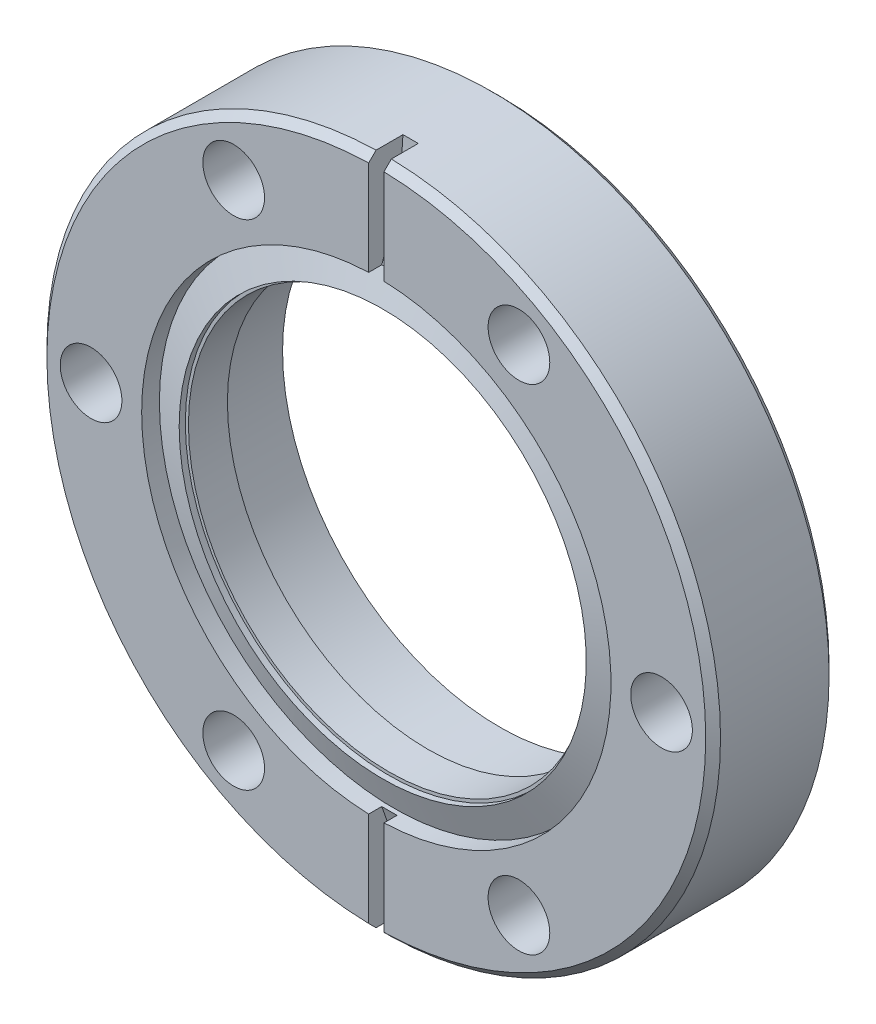
ISO-10303-21;
HEADER;
FILE_DESCRIPTION(('STEP AP214'),'2;1');
FILE_NAME('part.step','',(''),(''),'','','');
FILE_SCHEMA(('AUTOMOTIVE_DESIGN { 1 0 10303 214 1 1 1 1 }'));
ENDSEC;
DATA;
#1=APPLICATION_CONTEXT('core data for automotive mechanical design processes');
#2=APPLICATION_PROTOCOL_DEFINITION('international standard','automotive_design',2000,#1);
#3=PRODUCT_CONTEXT('',#1,'mechanical');
#4=PRODUCT('Part','Part','',(#3));
#5=PRODUCT_RELATED_PRODUCT_CATEGORY('part','',(#4));
#6=PRODUCT_DEFINITION_FORMATION('','',#4);
#7=PRODUCT_DEFINITION_CONTEXT('part definition',#1,'design');
#8=PRODUCT_DEFINITION('design','',#6,#7);
#9=PRODUCT_DEFINITION_SHAPE('','',#8);
#10=(LENGTH_UNIT() NAMED_UNIT(*) SI_UNIT(.MILLI.,.METRE.));
#11=(NAMED_UNIT(*) PLANE_ANGLE_UNIT() SI_UNIT($,.RADIAN.));
#12=(NAMED_UNIT(*) SI_UNIT($,.STERADIAN.) SOLID_ANGLE_UNIT());
#13=UNCERTAINTY_MEASURE_WITH_UNIT(LENGTH_MEASURE(1.E-05),#10,'distance_accuracy_value','');
#14=(GEOMETRIC_REPRESENTATION_CONTEXT(3) GLOBAL_UNCERTAINTY_ASSIGNED_CONTEXT((#13)) GLOBAL_UNIT_ASSIGNED_CONTEXT((#10,
#11,#12)) REPRESENTATION_CONTEXT('',''));
#15=CARTESIAN_POINT('',(0.,0.,0.));
#16=DIRECTION('',(0.,0.,1.));
#17=DIRECTION('',(1.,0.,0.));
#18=AXIS2_PLACEMENT_3D('',#15,#16,#17);
#19=CARTESIAN_POINT('',(0.,0.,0.));
#20=DIRECTION('',(0.,0.,-1.));
#21=DIRECTION('',(-1.,0.,0.));
#22=AXIS2_PLACEMENT_3D('',#19,#20,#21);
#23=CYLINDRICAL_SURFACE('',#22,20.9550000000005);
#24=CARTESIAN_POINT('',(0.,0.,11.4046000000001));
#25=DIRECTION('',(0.,0.,-1.));
#26=DIRECTION('',(-1.,0.,0.));
#27=AXIS2_PLACEMENT_3D('',#24,#25,#26);
#28=CIRCLE('',#27,20.9550000000005);
#29=CARTESIAN_POINT('',(-20.9550000000005,0.,11.4046000000001));
#30=VERTEX_POINT('',#29);
#31=EDGE_CURVE('E19',#30,#30,#28,.T.);
#32=ORIENTED_EDGE('',*,*,#31,.T.);
#33=EDGE_LOOP('',(#32));
#34=FACE_BOUND('',#33,.T.);
#35=CARTESIAN_POINT('',(0.,0.,12.0396000000003));
#36=DIRECTION('',(0.,0.,-1.));
#37=DIRECTION('',(-1.,0.,0.));
#38=AXIS2_PLACEMENT_3D('',#35,#36,#37);
#39=CIRCLE('',#38,20.9550000000001);
#40=CARTESIAN_POINT('',(-20.9550000000001,0.,12.0396000000003));
#41=VERTEX_POINT('',#40);
#42=EDGE_CURVE('E94',#41,#41,#39,.T.);
#43=ORIENTED_EDGE('',*,*,#42,.F.);
#44=EDGE_LOOP('',(#43));
#45=FACE_BOUND('',#44,.T.);
#46=ADVANCED_FACE('F16',(#34,#45),#23,.F.);
#47=CARTESIAN_POINT('',(0.,20.955,11.4045999999998));
#48=DIRECTION('',(0.,0.,-1.));
#49=DIRECTION('',(-1.,0.,0.));
#50=AXIS2_PLACEMENT_3D('',#47,#48,#49);
#51=PLANE('',#50);
#52=CARTESIAN_POINT('',(0.,0.,11.4046000000001));
#53=DIRECTION('',(0.,0.,1.));
#54=DIRECTION('',(1.,0.,0.));
#55=AXIS2_PLACEMENT_3D('',#52,#53,#54);
#56=CIRCLE('',#55,20.6375000000005);
#57=CARTESIAN_POINT('',(20.6375000000005,0.,11.4046000000001));
#58=VERTEX_POINT('',#57);
#59=EDGE_CURVE('E255',#58,#58,#56,.F.);
#60=ORIENTED_EDGE('',*,*,#59,.T.);
#61=EDGE_LOOP('',(#60));
#62=FACE_BOUND('',#61,.T.);
#63=ORIENTED_EDGE('',*,*,#31,.F.);
#64=EDGE_LOOP('',(#63));
#65=FACE_BOUND('',#64,.T.);
#66=ADVANCED_FACE('F375',(#62,#65),#51,.F.);
#67=CARTESIAN_POINT('',(0.,0.,10.8747496622545));
#68=DIRECTION('',(0.,0.,-1.));
#69=DIRECTION('',(0.,1.,0.));
#70=AXIS2_PLACEMENT_3D('',#67,#68,#69);
#71=CONICAL_SURFACE('',#70,24.1554000000005,1.22173047639603);
#72=ORIENTED_EDGE('',*,*,#42,.T.);
#73=EDGE_LOOP('',(#72));
#74=FACE_BOUND('',#73,.T.);
#75=CARTESIAN_POINT('',(0.,0.,10.8747496622546));
#76=DIRECTION('',(0.,0.,-1.));
#77=DIRECTION('',(-1.,0.,0.));
#78=AXIS2_PLACEMENT_3D('',#75,#76,#77);
#79=CIRCLE('',#78,24.1554000000005);
#80=CARTESIAN_POINT('',(-24.1554000000005,0.,10.8747496622546));
#81=VERTEX_POINT('',#80);
#82=EDGE_CURVE('E122',#81,#81,#79,.F.);
#83=ORIENTED_EDGE('',*,*,#82,.T.);
#84=EDGE_LOOP('',(#83));
#85=FACE_BOUND('',#84,.T.);
#86=ADVANCED_FACE('F261',(#74,#85),#71,.T.);
#87=CARTESIAN_POINT('',(-0.787400000000008,35.7647503648525,40.9005551970516));
#88=DIRECTION('',(1.,0.,0.));
#89=DIRECTION('',(0.,0.,-1.));
#90=AXIS2_PLACEMENT_3D('',#87,#88,#89);
#91=CYLINDRICAL_SURFACE('',#90,31.75);
#92=CARTESIAN_POINT('',(-0.787400000000029,24.1425630453775,11.3541973519459));
#93=CARTESIAN_POINT('',(-0.524933333333355,24.1511210151262,11.3508331839947));
#94=CARTESIAN_POINT('',(-0.262466666666681,24.1554000000005,11.349151100019));
#95=CARTESIAN_POINT('',(0.262466666666667,24.1554000000005,11.349151100019));
#96=CARTESIAN_POINT('',(0.524933333333341,24.1511210151262,11.3508331839946));
#97=CARTESIAN_POINT('',(0.787400000000015,24.1425630453775,11.3541973519459));
#98=B_SPLINE_CURVE_WITH_KNOTS('',3,(#92,#93,#94,#95,#96,#97),.UNSPECIFIED.,.F.,.F.,(4,2,4),(0.,
0.787520801034829,1.57504160206966),.UNSPECIFIED.);
#99=CARTESIAN_POINT('',(-0.787400000000018,24.1425630453772,11.3541973519461));
#100=VERTEX_POINT('',#99);
#101=CARTESIAN_POINT('',(0.787400000000004,24.1425630453772,11.3541973519461));
#102=VERTEX_POINT('',#101);
#103=EDGE_CURVE('E98',#100,#102,#98,.T.);
#104=ORIENTED_EDGE('',*,*,#103,.T.);
#105=CARTESIAN_POINT('',(0.787399999999994,35.7647503648525,40.9005551970516));
#106=DIRECTION('',(1.,0.,0.));
#107=DIRECTION('',(0.,0.,-1.));
#108=AXIS2_PLACEMENT_3D('',#105,#106,#107);
#109=CIRCLE('',#108,31.75);
#110=CARTESIAN_POINT('',(0.787400000000002,34.6620576746398,9.16970949715015));
#111=VERTEX_POINT('',#110);
#112=EDGE_CURVE('E96',#102,#111,#109,.T.);
#113=ORIENTED_EDGE('',*,*,#112,.T.);
#114=CARTESIAN_POINT('',(-0.787400000000024,34.6620576746398,9.16970949715015));
#115=CARTESIAN_POINT('',(-0.524933333333352,34.6680192248804,9.16950316571656));
#116=CARTESIAN_POINT('',(-0.262466666666679,34.6710000000008,9.16939999999977));
#117=CARTESIAN_POINT('',(0.262466666666666,34.6710000000008,9.16939999999977));
#118=CARTESIAN_POINT('',(0.524933333333339,34.6680192248804,9.16950316571656));
#119=CARTESIAN_POINT('',(0.787400000000011,34.6620576746398,9.16970949715015));
#120=B_SPLINE_CURVE_WITH_KNOTS('',3,(#114,#115,#116,#117,#118,#119),.UNSPECIFIED.,.F.,.F.,(4,2,
4),(0.,0.787450837177392,1.57490167435478),.UNSPECIFIED.);
#121=CARTESIAN_POINT('',(-0.787400000000016,34.6620576746398,9.16970949715015));
#122=VERTEX_POINT('',#121);
#123=EDGE_CURVE('E83',#122,#111,#120,.T.);
#124=ORIENTED_EDGE('',*,*,#123,.F.);
#125=CARTESIAN_POINT('',(-0.787400000000008,35.7647503648525,40.9005551970516));
#126=DIRECTION('',(1.,0.,0.));
#127=DIRECTION('',(0.,0.,-1.));
#128=AXIS2_PLACEMENT_3D('',#125,#126,#127);
#129=CIRCLE('',#128,31.75);
#130=EDGE_CURVE('E119',#100,#122,#129,.T.);
#131=ORIENTED_EDGE('',*,*,#130,.F.);
#132=EDGE_LOOP('',(#104,#113,#124,#131));
#133=FACE_BOUND('',#132,.T.);
#134=ADVANCED_FACE('F97',(#133),#91,.F.);
#135=CARTESIAN_POINT('',(-0.787400000000008,-35.7647503648532,40.900555197052));
#136=DIRECTION('',(1.,0.,0.));
#137=DIRECTION('',(0.,0.,-1.));
#138=AXIS2_PLACEMENT_3D('',#135,#136,#137);
#139=CYLINDRICAL_SURFACE('',#138,31.75);
#140=CARTESIAN_POINT('',(0.787399999999994,-35.7647503648532,40.900555197052));
#141=DIRECTION('',(1.,0.,0.));
#142=DIRECTION('',(0.,0.,-1.));
#143=AXIS2_PLACEMENT_3D('',#140,#141,#142);
#144=CIRCLE('',#143,31.75);
#145=CARTESIAN_POINT('',(0.787399999999998,-34.6620576746398,9.16970949715062));
#146=VERTEX_POINT('',#145);
#147=CARTESIAN_POINT('',(0.787399999999994,-24.1425630453774,11.3541973519467));
#148=VERTEX_POINT('',#147);
#149=EDGE_CURVE('E222',#146,#148,#144,.T.);
#150=ORIENTED_EDGE('',*,*,#149,.T.);
#151=CARTESIAN_POINT('',(0.787399999999995,-24.1425630453775,11.3541973519466));
#152=CARTESIAN_POINT('',(0.524933333333328,-24.1511210151262,11.3508331839953));
#153=CARTESIAN_POINT('',(0.26246666666666,-24.1554000000005,11.3491511000197));
#154=CARTESIAN_POINT('',(-0.262466666666674,-24.1554000000005,11.3491511000197));
#155=CARTESIAN_POINT('',(-0.524933333333342,-24.1511210151262,11.3508331839953));
#156=CARTESIAN_POINT('',(-0.787400000000009,-24.1425630453775,11.3541973519466));
#157=B_SPLINE_CURVE_WITH_KNOTS('',3,(#151,#152,#153,#154,#155,#156),.UNSPECIFIED.,.F.,.F.,(4,2,
4),(0.,0.78752080103481,1.57504160206962),.UNSPECIFIED.);
#158=CARTESIAN_POINT('',(-0.787400000000008,-24.1425630453774,11.3541973519467));
#159=VERTEX_POINT('',#158);
#160=EDGE_CURVE('E125',#148,#159,#157,.T.);
#161=ORIENTED_EDGE('',*,*,#160,.T.);
#162=CARTESIAN_POINT('',(-0.787400000000008,-35.7647503648532,40.900555197052));
#163=DIRECTION('',(1.,0.,0.));
#164=DIRECTION('',(0.,0.,-1.));
#165=AXIS2_PLACEMENT_3D('',#162,#163,#164);
#166=CIRCLE('',#165,31.75);
#167=CARTESIAN_POINT('',(-0.787400000000007,-34.6620576746398,9.16970949715062));
#168=VERTEX_POINT('',#167);
#169=EDGE_CURVE('E197',#168,#159,#166,.T.);
#170=ORIENTED_EDGE('',*,*,#169,.F.);
#171=CARTESIAN_POINT('',(0.787400000000003,-34.6620576746398,9.16970949715062));
#172=CARTESIAN_POINT('',(0.524933333333335,-34.6680192248804,9.16950316571703));
#173=CARTESIAN_POINT('',(0.262466666666667,-34.6710000000008,9.16940000000023));
#174=CARTESIAN_POINT('',(-0.26246666666667,-34.6710000000008,9.16940000000023));
#175=CARTESIAN_POINT('',(-0.524933333333338,-34.6680192248804,9.16950316571703));
#176=CARTESIAN_POINT('',(-0.787400000000006,-34.6620576746398,9.16970949715062));
#177=B_SPLINE_CURVE_WITH_KNOTS('',3,(#171,#172,#173,#174,#175,#176),.UNSPECIFIED.,.F.,.F.,(4,2,
4),(0.,0.787450837177379,1.57490167435476),.UNSPECIFIED.);
#178=EDGE_CURVE('E93',#146,#168,#177,.T.);
#179=ORIENTED_EDGE('',*,*,#178,.F.);
#180=EDGE_LOOP('',(#150,#161,#170,#179));
#181=FACE_BOUND('',#180,.T.);
#182=ADVANCED_FACE('F260',(#181),#139,.F.);
#183=CARTESIAN_POINT('',(0.,0.,0.));
#184=DIRECTION('',(0.,0.,1.));
#185=DIRECTION('',(1.,0.,0.));
#186=AXIS2_PLACEMENT_3D('',#183,#184,#185);
#187=CYLINDRICAL_SURFACE('',#186,20.6375000000005);
#188=ORIENTED_EDGE('',*,*,#59,.F.);
#189=EDGE_LOOP('',(#188));
#190=FACE_BOUND('',#189,.T.);
#191=CARTESIAN_POINT('',(0.,0.,7.39140000000014));
#192=DIRECTION('',(0.,0.,1.));
#193=DIRECTION('',(1.,0.,0.));
#194=AXIS2_PLACEMENT_3D('',#191,#192,#193);
#195=CIRCLE('',#194,20.6375000000005);
#196=CARTESIAN_POINT('',(20.6375000000005,0.,7.39140000000014));
#197=VERTEX_POINT('',#196);
#198=EDGE_CURVE('E186',#197,#197,#195,.T.);
#199=ORIENTED_EDGE('',*,*,#198,.F.);
#200=EDGE_LOOP('',(#199));
#201=FACE_BOUND('',#200,.T.);
#202=ADVANCED_FACE('F240',(#190,#201),#187,.F.);
#203=CARTESIAN_POINT('',(0.,0.,0.));
#204=DIRECTION('',(0.,0.,-1.));
#205=DIRECTION('',(-1.,0.,0.));
#206=AXIS2_PLACEMENT_3D('',#203,#204,#205);
#207=CYLINDRICAL_SURFACE('',#206,24.1554000000005);
#208=ORIENTED_EDGE('',*,*,#82,.F.);
#209=EDGE_LOOP('',(#208));
#210=FACE_BOUND('',#209,.T.);
#211=CARTESIAN_POINT('',(0.,0.,12.7000000000001));
#212=DIRECTION('',(0.,0.,-1.));
#213=DIRECTION('',(-1.,0.,0.));
#214=AXIS2_PLACEMENT_3D('',#211,#212,#213);
#215=CIRCLE('',#214,24.1554000000005);
#216=CARTESIAN_POINT('',(0.787399999999994,24.1425630453772,12.7));
#217=VERTEX_POINT('',#216);
#218=CARTESIAN_POINT('',(0.787399999999994,-24.1425630453774,12.7000000000001));
#219=VERTEX_POINT('',#218);
#220=EDGE_CURVE('E112',#217,#219,#215,.T.);
#221=ORIENTED_EDGE('',*,*,#220,.F.);
#222=DIRECTION('',(0.,0.,-1.));
#223=VECTOR('',#222,1.);
#224=CARTESIAN_POINT('',(0.787399999999994,24.1425630453769,40.9005551970516));
#225=LINE('',#224,#223);
#226=EDGE_CURVE('E103',#217,#102,#225,.T.);
#227=ORIENTED_EDGE('',*,*,#226,.T.);
#228=ORIENTED_EDGE('',*,*,#103,.F.);
#229=DIRECTION('',(0.,0.,-1.));
#230=VECTOR('',#229,1.);
#231=CARTESIAN_POINT('',(-0.787400000000008,24.1425630453769,40.9005551970516));
#232=LINE('',#231,#230);
#233=CARTESIAN_POINT('',(-0.787400000000008,24.1425630453772,12.7000000000001));
#234=VERTEX_POINT('',#233);
#235=EDGE_CURVE('E117',#234,#100,#232,.T.);
#236=ORIENTED_EDGE('',*,*,#235,.F.);
#237=CARTESIAN_POINT('',(0.,0.,12.7000000000001));
#238=DIRECTION('',(0.,0.,-1.));
#239=DIRECTION('',(-1.,0.,0.));
#240=AXIS2_PLACEMENT_3D('',#237,#238,#239);
#241=CIRCLE('',#240,24.1554000000005);
#242=CARTESIAN_POINT('',(-0.787400000000008,-24.1425630453774,12.7000000000001));
#243=VERTEX_POINT('',#242);
#244=EDGE_CURVE('E178',#243,#234,#241,.T.);
#245=ORIENTED_EDGE('',*,*,#244,.F.);
#246=DIRECTION('',(0.,0.,-1.));
#247=VECTOR('',#246,1.);
#248=CARTESIAN_POINT('',(-0.787400000000008,-24.1425630453774,40.900555197052));
#249=LINE('',#248,#247);
#250=EDGE_CURVE('E196',#159,#243,#249,.F.);
#251=ORIENTED_EDGE('',*,*,#250,.F.);
#252=ORIENTED_EDGE('',*,*,#160,.F.);
#253=DIRECTION('',(0.,0.,-1.));
#254=VECTOR('',#253,1.);
#255=CARTESIAN_POINT('',(0.787399999999994,-24.1425630453774,40.900555197052));
#256=LINE('',#255,#254);
#257=EDGE_CURVE('E221',#148,#219,#256,.F.);
#258=ORIENTED_EDGE('',*,*,#257,.T.);
#259=EDGE_LOOP('',(#221,#227,#228,#236,#245,#251,#252,#258));
#260=FACE_BOUND('',#259,.T.);
#261=ADVANCED_FACE('F235',(#210,#260),#207,.F.);
#262=CARTESIAN_POINT('',(-0.787400000000008,35.7647503648525,40.9005551970516));
#263=DIRECTION('',(1.,0.,0.));
#264=DIRECTION('',(0.,0.,-1.));
#265=AXIS2_PLACEMENT_3D('',#262,#263,#264);
#266=PLANE('',#265);
#267=ORIENTED_EDGE('',*,*,#235,.T.);
#268=ORIENTED_EDGE('',*,*,#130,.T.);
#269=DIRECTION('',(0.,0.,-1.));
#270=VECTOR('',#269,1.);
#271=CARTESIAN_POINT('',(-0.787400000000022,34.6620576746398,12.7000000000001));
#272=LINE('',#271,#270);
#273=CARTESIAN_POINT('',(-0.787400000000019,34.6620576746398,11.9379999999996));
#274=VERTEX_POINT('',#273);
#275=EDGE_CURVE('E92',#274,#122,#272,.T.);
#276=ORIENTED_EDGE('',*,*,#275,.F.);
#277=DIRECTION('',(0.,0.707200025081543,-0.707013524994158));
#278=VECTOR('',#277,1.);
#279=CARTESIAN_POINT('',(-0.787400000000008,33.8998566699035,12.6999999999999));
#280=LINE('',#279,#278);
#281=CARTESIAN_POINT('',(-0.787400000000008,33.8998566699034,12.7000000000005));
#282=VERTEX_POINT('',#281);
#283=EDGE_CURVE('E120',#274,#282,#280,.F.);
#284=ORIENTED_EDGE('',*,*,#283,.T.);
#285=DIRECTION('',(0.,1.,0.));
#286=VECTOR('',#285,1.);
#287=CARTESIAN_POINT('',(-0.787400000000008,0.,12.7000000000001));
#288=LINE('',#287,#286);
#289=EDGE_CURVE('E181',#234,#282,#288,.T.);
#290=ORIENTED_EDGE('',*,*,#289,.F.);
#291=EDGE_LOOP('',(#267,#268,#276,#284,#290));
#292=FACE_BOUND('',#291,.T.);
#293=ADVANCED_FACE('F232',(#292),#266,.T.);
#294=CARTESIAN_POINT('',(0.787399999999994,35.7647503648525,40.9005551970516));
#295=DIRECTION('',(1.,0.,0.));
#296=DIRECTION('',(0.,0.,-1.));
#297=AXIS2_PLACEMENT_3D('',#294,#295,#296);
#298=PLANE('',#297);
#299=ORIENTED_EDGE('',*,*,#226,.F.);
#300=DIRECTION('',(0.,1.,0.));
#301=VECTOR('',#300,1.);
#302=CARTESIAN_POINT('',(0.787399999999994,0.,12.7000000000001));
#303=LINE('',#302,#301);
#304=CARTESIAN_POINT('',(0.787399999999994,33.899856669904,12.7000000000004));
#305=VERTEX_POINT('',#304);
#306=EDGE_CURVE('E173',#305,#217,#303,.F.);
#307=ORIENTED_EDGE('',*,*,#306,.F.);
#308=CARTESIAN_POINT('',(0.787399999999994,34.6620576746397,11.9380000000002));
#309=CARTESIAN_POINT('',(0.787399999999994,34.5350245461305,12.0650003723785));
#310=CARTESIAN_POINT('',(0.787399999999994,34.4079912314812,12.1920005585677));
#311=CARTESIAN_POINT('',(0.787399999999994,34.1539242299027,12.4460005585678));
#312=CARTESIAN_POINT('',(0.787399999999994,34.0268905429733,12.5730003723787));
#313=CARTESIAN_POINT('',(0.787399999999994,33.899856669904,12.7000000000004));
#314=B_SPLINE_CURVE_WITH_KNOTS('',3,(#308,#309,#310,#311,#312,#313),.UNSPECIFIED.,.F.,.F.,(4,2,
4),(0.,0.538886437856589,1.0777728757132),.UNSPECIFIED.);
#315=CARTESIAN_POINT('',(0.787400000000002,34.6620576746398,11.938));
#316=VERTEX_POINT('',#315);
#317=EDGE_CURVE('E102',#316,#305,#314,.T.);
#318=ORIENTED_EDGE('',*,*,#317,.F.);
#319=DIRECTION('',(0.,0.,-1.));
#320=VECTOR('',#319,1.);
#321=CARTESIAN_POINT('',(0.78740000000001,34.6620576746398,12.7000000000001));
#322=LINE('',#321,#320);
#323=EDGE_CURVE('E90',#111,#316,#322,.F.);
#324=ORIENTED_EDGE('',*,*,#323,.F.);
#325=ORIENTED_EDGE('',*,*,#112,.F.);
#326=EDGE_LOOP('',(#299,#307,#318,#324,#325));
#327=FACE_BOUND('',#326,.T.);
#328=ADVANCED_FACE('F106',(#327),#298,.F.);
#329=CARTESIAN_POINT('',(0.,0.,11.9380000000002));
#330=DIRECTION('',(0.,0.,-1.));
#331=DIRECTION('',(0.,1.,0.));
#332=AXIS2_PLACEMENT_3D('',#329,#330,#331);
#333=CONICAL_SURFACE('',#332,34.6710000000007,0.785398163397452);
#334=ORIENTED_EDGE('',*,*,#317,.T.);
#335=CARTESIAN_POINT('',(0.,0.,12.7000000000004));
#336=DIRECTION('',(0.,0.,-1.));
#337=DIRECTION('',(0.,1.,0.));
#338=AXIS2_PLACEMENT_3D('',#335,#336,#337);
#339=CIRCLE('',#338,33.9090000000005);
#340=CARTESIAN_POINT('',(0.787399999999994,-33.8998566699041,12.7000000000003));
#341=VERTEX_POINT('',#340);
#342=EDGE_CURVE('E174',#341,#305,#339,.F.);
#343=ORIENTED_EDGE('',*,*,#342,.F.);
#344=CARTESIAN_POINT('',(0.787399999999994,-33.8998566699041,12.7000000000003));
#345=CARTESIAN_POINT('',(0.787399999999994,-34.0268905429735,12.5730003723785));
#346=CARTESIAN_POINT('',(0.787399999999994,-34.1539242299028,12.4460005585676));
#347=CARTESIAN_POINT('',(0.787399999999994,-34.4079912314813,12.1920005585676));
#348=CARTESIAN_POINT('',(0.787399999999994,-34.5350245461306,12.0650003723784));
#349=CARTESIAN_POINT('',(0.787399999999994,-34.6620576746398,11.9380000000001));
#350=B_SPLINE_CURVE_WITH_KNOTS('',3,(#344,#345,#346,#347,#348,#349),.UNSPECIFIED.,.F.,.F.,(4,2,
4),(0.,0.538886437856525,1.07777287571302),.UNSPECIFIED.);
#351=CARTESIAN_POINT('',(0.787400000000002,-34.6620576746398,11.9380000000001));
#352=VERTEX_POINT('',#351);
#353=EDGE_CURVE('E215',#341,#352,#350,.T.);
#354=ORIENTED_EDGE('',*,*,#353,.T.);
#355=CARTESIAN_POINT('',(0.,0.,11.9380000000001));
#356=DIRECTION('',(0.,0.,-1.));
#357=DIRECTION('',(-1.,0.,0.));
#358=AXIS2_PLACEMENT_3D('',#355,#356,#357);
#359=CIRCLE('',#358,34.6710000000008);
#360=EDGE_CURVE('E108',#316,#352,#359,.T.);
#361=ORIENTED_EDGE('',*,*,#360,.F.);
#362=EDGE_LOOP('',(#334,#343,#354,#361));
#363=FACE_BOUND('',#362,.T.);
#364=ADVANCED_FACE('F211',(#363),#333,.T.);
#365=CARTESIAN_POINT('',(0.787399999999994,-35.7647503648532,40.900555197052));
#366=DIRECTION('',(1.,0.,0.));
#367=DIRECTION('',(0.,0.,-1.));
#368=AXIS2_PLACEMENT_3D('',#365,#366,#367);
#369=PLANE('',#368);
#370=DIRECTION('',(0.,1.,0.));
#371=VECTOR('',#370,1.);
#372=CARTESIAN_POINT('',(0.787399999999994,0.,12.7000000000001));
#373=LINE('',#372,#371);
#374=EDGE_CURVE('E177',#219,#341,#373,.F.);
#375=ORIENTED_EDGE('',*,*,#374,.F.);
#376=ORIENTED_EDGE('',*,*,#257,.F.);
#377=ORIENTED_EDGE('',*,*,#149,.F.);
#378=DIRECTION('',(0.,0.,-1.));
#379=VECTOR('',#378,1.);
#380=CARTESIAN_POINT('',(0.787400000000011,-34.6620576746398,12.7000000000001));
#381=LINE('',#380,#379);
#382=EDGE_CURVE('E110',#352,#146,#381,.T.);
#383=ORIENTED_EDGE('',*,*,#382,.F.);
#384=ORIENTED_EDGE('',*,*,#353,.F.);
#385=EDGE_LOOP('',(#375,#376,#377,#383,#384));
#386=FACE_BOUND('',#385,.T.);
#387=ADVANCED_FACE('F206',(#386),#369,.F.);
#388=CARTESIAN_POINT('',(-0.787400000000008,-35.7647503648532,40.900555197052));
#389=DIRECTION('',(1.,0.,0.));
#390=DIRECTION('',(0.,0.,-1.));
#391=AXIS2_PLACEMENT_3D('',#388,#389,#390);
#392=PLANE('',#391);
#393=DIRECTION('',(0.,1.,0.));
#394=VECTOR('',#393,1.);
#395=CARTESIAN_POINT('',(-0.787400000000008,0.,12.7000000000001));
#396=LINE('',#395,#394);
#397=CARTESIAN_POINT('',(-0.787400000000008,-33.8998566699042,12.7000000000002));
#398=VERTEX_POINT('',#397);
#399=EDGE_CURVE('E182',#398,#243,#396,.T.);
#400=ORIENTED_EDGE('',*,*,#399,.F.);
#401=CARTESIAN_POINT('',(-0.787400000000008,-34.6620576746397,11.9380000000002));
#402=CARTESIAN_POINT('',(-0.787400000000008,-34.5350245461305,12.0650003723785));
#403=CARTESIAN_POINT('',(-0.787400000000008,-34.4079912314813,12.1920005585676));
#404=CARTESIAN_POINT('',(-0.787400000000008,-34.1539242299028,12.4460005585676));
#405=CARTESIAN_POINT('',(-0.787400000000008,-34.0268905429735,12.5730003723785));
#406=CARTESIAN_POINT('',(-0.787400000000008,-33.8998566699042,12.7000000000002));
#407=B_SPLINE_CURVE_WITH_KNOTS('',3,(#401,#402,#403,#404,#405,#406),.UNSPECIFIED.,.F.,.F.,(4,2,
4),(0.,0.538886437856446,1.07777287571291),.UNSPECIFIED.);
#408=CARTESIAN_POINT('',(-0.787400000000003,-34.6620576746398,11.9380000000002));
#409=VERTEX_POINT('',#408);
#410=EDGE_CURVE('E189',#409,#398,#407,.T.);
#411=ORIENTED_EDGE('',*,*,#410,.F.);
#412=DIRECTION('',(0.,0.,-1.));
#413=VECTOR('',#412,1.);
#414=CARTESIAN_POINT('',(-0.787399999999998,-34.6620576746398,12.7000000000001));
#415=LINE('',#414,#413);
#416=EDGE_CURVE('E34',#168,#409,#415,.F.);
#417=ORIENTED_EDGE('',*,*,#416,.F.);
#418=ORIENTED_EDGE('',*,*,#169,.T.);
#419=ORIENTED_EDGE('',*,*,#250,.T.);
#420=EDGE_LOOP('',(#400,#411,#417,#418,#419));
#421=FACE_BOUND('',#420,.T.);
#422=ADVANCED_FACE('F202',(#421),#392,.T.);
#423=CARTESIAN_POINT('',(0.,0.,11.9380000000002));
#424=DIRECTION('',(0.,0.,-1.));
#425=DIRECTION('',(0.,1.,0.));
#426=AXIS2_PLACEMENT_3D('',#423,#424,#425);
#427=CONICAL_SURFACE('',#426,34.6710000000007,0.785398163397451);
#428=CARTESIAN_POINT('',(0.,0.,11.9380000000001));
#429=DIRECTION('',(0.,0.,-1.));
#430=DIRECTION('',(-1.,0.,0.));
#431=AXIS2_PLACEMENT_3D('',#428,#429,#430);
#432=CIRCLE('',#431,34.6710000000008);
#433=EDGE_CURVE('E170',#409,#274,#432,.T.);
#434=ORIENTED_EDGE('',*,*,#433,.F.);
#435=ORIENTED_EDGE('',*,*,#410,.T.);
#436=CARTESIAN_POINT('',(0.,0.,12.7000000000002));
#437=DIRECTION('',(0.,0.,-1.));
#438=DIRECTION('',(0.,1.,0.));
#439=AXIS2_PLACEMENT_3D('',#436,#437,#438);
#440=CIRCLE('',#439,33.9090000000007);
#441=EDGE_CURVE('E183',#282,#398,#440,.F.);
#442=ORIENTED_EDGE('',*,*,#441,.F.);
#443=ORIENTED_EDGE('',*,*,#283,.F.);
#444=EDGE_LOOP('',(#434,#435,#442,#443));
#445=FACE_BOUND('',#444,.T.);
#446=ADVANCED_FACE('F199',(#445),#427,.T.);
#447=CARTESIAN_POINT('',(0.,0.,7.39140000000014));
#448=DIRECTION('',(0.,0.,-1.));
#449=DIRECTION('',(-1.,0.,0.));
#450=AXIS2_PLACEMENT_3D('',#447,#448,#449);
#451=PLANE('',#450);
#452=ORIENTED_EDGE('',*,*,#198,.T.);
#453=EDGE_LOOP('',(#452));
#454=FACE_BOUND('',#453,.T.);
#455=CARTESIAN_POINT('',(0.,0.,7.39140000000014));
#456=DIRECTION('',(0.,0.,-1.));
#457=DIRECTION('',(-1.,0.,0.));
#458=AXIS2_PLACEMENT_3D('',#455,#456,#457);
#459=CIRCLE('',#458,22.3520000000005);
#460=CARTESIAN_POINT('',(-22.3520000000005,0.,7.39140000000014));
#461=VERTEX_POINT('',#460);
#462=EDGE_CURVE('E167',#461,#461,#459,.T.);
#463=ORIENTED_EDGE('',*,*,#462,.T.);
#464=EDGE_LOOP('',(#463));
#465=FACE_BOUND('',#464,.T.);
#466=ADVANCED_FACE('F284',(#454,#465),#451,.T.);
#467=CARTESIAN_POINT('',(0.,0.,12.7000000000001));
#468=DIRECTION('',(0.,0.,1.));
#469=DIRECTION('',(1.,0.,0.));
#470=AXIS2_PLACEMENT_3D('',#467,#468,#469);
#471=PLANE('',#470);
#472=ORIENTED_EDGE('',*,*,#244,.T.);
#473=ORIENTED_EDGE('',*,*,#289,.T.);
#474=ORIENTED_EDGE('',*,*,#441,.T.);
#475=ORIENTED_EDGE('',*,*,#399,.T.);
#476=EDGE_LOOP('',(#472,#473,#474,#475));
#477=FACE_BOUND('',#476,.T.);
#478=CARTESIAN_POINT('',(-14.6811999999998,25.4285843160803,12.7));
#479=DIRECTION('',(0.,0.,1.));
#480=DIRECTION('',(1.,0.,0.));
#481=AXIS2_PLACEMENT_3D('',#478,#479,#480);
#482=CIRCLE('',#481,3.17500000000008);
#483=CARTESIAN_POINT('',(-11.5061999999997,25.4285843160803,12.7));
#484=VERTEX_POINT('',#483);
#485=EDGE_CURVE('E161',#484,#484,#482,.F.);
#486=ORIENTED_EDGE('',*,*,#485,.T.);
#487=EDGE_LOOP('',(#486));
#488=FACE_BOUND('',#487,.T.);
#489=CARTESIAN_POINT('',(-29.3624000000008,2.08166817117217E-13,12.7000000000003));
#490=DIRECTION('',(0.,0.,1.));
#491=DIRECTION('',(1.,0.,0.));
#492=AXIS2_PLACEMENT_3D('',#489,#490,#491);
#493=CIRCLE('',#492,3.17500000000008);
#494=CARTESIAN_POINT('',(-26.1874000000007,2.08166817117217E-13,12.7000000000003));
#495=VERTEX_POINT('',#494);
#496=EDGE_CURVE('E158',#495,#495,#493,.F.);
#497=ORIENTED_EDGE('',*,*,#496,.T.);
#498=EDGE_LOOP('',(#497));
#499=FACE_BOUND('',#498,.T.);
#500=CARTESIAN_POINT('',(-14.6812000000002,-25.4285843160807,12.7000000000003));
#501=DIRECTION('',(0.,0.,1.));
#502=DIRECTION('',(1.,0.,0.));
#503=AXIS2_PLACEMENT_3D('',#500,#501,#502);
#504=CIRCLE('',#503,3.17500000000008);
#505=CARTESIAN_POINT('',(-11.5062000000001,-25.4285843160807,12.7000000000003));
#506=VERTEX_POINT('',#505);
#507=EDGE_CURVE('E155',#506,#506,#504,.F.);
#508=ORIENTED_EDGE('',*,*,#507,.T.);
#509=EDGE_LOOP('',(#508));
#510=FACE_BOUND('',#509,.T.);
#511=ADVANCED_FACE('F281',(#477,#488,#499,#510),#471,.T.);
#512=CARTESIAN_POINT('',(0.,0.,12.7000000000001));
#513=DIRECTION('',(0.,0.,1.));
#514=DIRECTION('',(1.,0.,0.));
#515=AXIS2_PLACEMENT_3D('',#512,#513,#514);
#516=PLANE('',#515);
#517=CARTESIAN_POINT('',(14.6812000000004,25.42858431608,12.6999999999997));
#518=DIRECTION('',(0.,0.,1.));
#519=DIRECTION('',(1.,0.,0.));
#520=AXIS2_PLACEMENT_3D('',#517,#518,#519);
#521=CIRCLE('',#520,3.17500000000008);
#522=CARTESIAN_POINT('',(17.8562000000004,25.42858431608,12.6999999999997));
#523=VERTEX_POINT('',#522);
#524=EDGE_CURVE('E164',#523,#523,#521,.F.);
#525=ORIENTED_EDGE('',*,*,#524,.T.);
#526=EDGE_LOOP('',(#525));
#527=FACE_BOUND('',#526,.T.);
#528=CARTESIAN_POINT('',(14.6812,-25.4285843160808,12.7));
#529=DIRECTION('',(0.,0.,1.));
#530=DIRECTION('',(1.,0.,0.));
#531=AXIS2_PLACEMENT_3D('',#528,#529,#530);
#532=CIRCLE('',#531,3.17500000000008);
#533=CARTESIAN_POINT('',(17.8562000000001,-25.4285843160808,12.7));
#534=VERTEX_POINT('',#533);
#535=EDGE_CURVE('E152',#534,#534,#532,.F.);
#536=ORIENTED_EDGE('',*,*,#535,.T.);
#537=EDGE_LOOP('',(#536));
#538=FACE_BOUND('',#537,.T.);
#539=CARTESIAN_POINT('',(29.3624000000007,0.,12.7));
#540=DIRECTION('',(0.,0.,1.));
#541=DIRECTION('',(1.,0.,0.));
#542=AXIS2_PLACEMENT_3D('',#539,#540,#541);
#543=CIRCLE('',#542,3.17500000000008);
#544=CARTESIAN_POINT('',(32.5374000000008,0.,12.7));
#545=VERTEX_POINT('',#544);
#546=EDGE_CURVE('E149',#545,#545,#543,.F.);
#547=ORIENTED_EDGE('',*,*,#546,.T.);
#548=EDGE_LOOP('',(#547));
#549=FACE_BOUND('',#548,.T.);
#550=ORIENTED_EDGE('',*,*,#306,.T.);
#551=ORIENTED_EDGE('',*,*,#220,.T.);
#552=ORIENTED_EDGE('',*,*,#374,.T.);
#553=ORIENTED_EDGE('',*,*,#342,.T.);
#554=EDGE_LOOP('',(#550,#551,#552,#553));
#555=FACE_BOUND('',#554,.T.);
#556=ADVANCED_FACE('F276',(#527,#538,#549,#555),#516,.T.);
#557=CARTESIAN_POINT('',(0.,0.,12.7000000000001));
#558=DIRECTION('',(0.,0.,-1.));
#559=DIRECTION('',(-1.,0.,0.));
#560=AXIS2_PLACEMENT_3D('',#557,#558,#559);
#561=CYLINDRICAL_SURFACE('',#560,34.6710000000008);
#562=ORIENTED_EDGE('',*,*,#323,.T.);
#563=ORIENTED_EDGE('',*,*,#360,.T.);
#564=ORIENTED_EDGE('',*,*,#382,.T.);
#565=ORIENTED_EDGE('',*,*,#178,.T.);
#566=ORIENTED_EDGE('',*,*,#416,.T.);
#567=ORIENTED_EDGE('',*,*,#433,.T.);
#568=ORIENTED_EDGE('',*,*,#275,.T.);
#569=ORIENTED_EDGE('',*,*,#123,.T.);
#570=EDGE_LOOP('',(#562,#563,#564,#565,#566,#567,#568,#569));
#571=FACE_BOUND('',#570,.T.);
#572=CARTESIAN_POINT('',(0.,0.,0.761999999999603));
#573=DIRECTION('',(0.,0.,1.));
#574=DIRECTION('',(1.,0.,0.));
#575=AXIS2_PLACEMENT_3D('',#572,#573,#574);
#576=CIRCLE('',#575,34.6710000000004);
#577=CARTESIAN_POINT('',(34.6710000000004,0.,0.7619999999996));
#578=VERTEX_POINT('',#577);
#579=EDGE_CURVE('E148',#578,#578,#576,.F.);
#580=ORIENTED_EDGE('',*,*,#579,.F.);
#581=EDGE_LOOP('',(#580));
#582=FACE_BOUND('',#581,.T.);
#583=ADVANCED_FACE('F87',(#571,#582),#561,.T.);
#584=CARTESIAN_POINT('',(0.,0.,7.39140000000014));
#585=DIRECTION('',(0.,0.,-1.));
#586=DIRECTION('',(-1.,0.,0.));
#587=AXIS2_PLACEMENT_3D('',#584,#585,#586);
#588=CYLINDRICAL_SURFACE('',#587,22.3520000000005);
#589=ORIENTED_EDGE('',*,*,#462,.F.);
#590=EDGE_LOOP('',(#589));
#591=FACE_BOUND('',#590,.T.);
#592=CARTESIAN_POINT('',(0.,0.,0.));
#593=DIRECTION('',(0.,0.,-1.));
#594=DIRECTION('',(-1.,0.,0.));
#595=AXIS2_PLACEMENT_3D('',#592,#593,#594);
#596=CIRCLE('',#595,22.3520000000005);
#597=CARTESIAN_POINT('',(-22.3520000000005,0.,0.));
#598=VERTEX_POINT('',#597);
#599=EDGE_CURVE('E145',#598,#598,#596,.T.);
#600=ORIENTED_EDGE('',*,*,#599,.T.);
#601=EDGE_LOOP('',(#600));
#602=FACE_BOUND('',#601,.T.);
#603=ADVANCED_FACE('F275',(#591,#602),#588,.F.);
#604=CARTESIAN_POINT('',(14.6812000000004,25.42858431608,1.45716771982052E-13));
#605=DIRECTION('',(0.,0.,1.));
#606=DIRECTION('',(1.,0.,0.));
#607=AXIS2_PLACEMENT_3D('',#604,#605,#606);
#608=CYLINDRICAL_SURFACE('',#607,3.17500000000008);
#609=CARTESIAN_POINT('',(14.6812000000004,25.42858431608,1.45716771982052E-13));
#610=DIRECTION('',(0.,0.,1.));
#611=DIRECTION('',(1.,0.,0.));
#612=AXIS2_PLACEMENT_3D('',#609,#610,#611);
#613=CIRCLE('',#612,3.17500000000008);
#614=CARTESIAN_POINT('',(17.8562000000004,25.42858431608,1.45716771982052E-13));
#615=VERTEX_POINT('',#614);
#616=EDGE_CURVE('E142',#615,#615,#613,.F.);
#617=ORIENTED_EDGE('',*,*,#616,.T.);
#618=EDGE_LOOP('',(#617));
#619=FACE_BOUND('',#618,.T.);
#620=ORIENTED_EDGE('',*,*,#524,.F.);
#621=EDGE_LOOP('',(#620));
#622=FACE_BOUND('',#621,.T.);
#623=ADVANCED_FACE('F325',(#619,#622),#608,.F.);
#624=CARTESIAN_POINT('',(-14.6811999999998,25.4285843160803,0.));
#625=DIRECTION('',(0.,0.,1.));
#626=DIRECTION('',(1.,0.,0.));
#627=AXIS2_PLACEMENT_3D('',#624,#625,#626);
#628=CYLINDRICAL_SURFACE('',#627,3.17500000000008);
#629=CARTESIAN_POINT('',(-14.6811999999998,25.4285843160803,0.));
#630=DIRECTION('',(0.,0.,1.));
#631=DIRECTION('',(1.,0.,0.));
#632=AXIS2_PLACEMENT_3D('',#629,#630,#631);
#633=CIRCLE('',#632,3.17500000000008);
#634=CARTESIAN_POINT('',(-11.5061999999997,25.4285843160803,0.));
#635=VERTEX_POINT('',#634);
#636=EDGE_CURVE('E139',#635,#635,#633,.F.);
#637=ORIENTED_EDGE('',*,*,#636,.T.);
#638=EDGE_LOOP('',(#637));
#639=FACE_BOUND('',#638,.T.);
#640=ORIENTED_EDGE('',*,*,#485,.F.);
#641=EDGE_LOOP('',(#640));
#642=FACE_BOUND('',#641,.T.);
#643=ADVANCED_FACE('F322',(#639,#642),#628,.F.);
#644=CARTESIAN_POINT('',(-29.3624000000008,2.08166817117217E-13,0.));
#645=DIRECTION('',(0.,0.,1.));
#646=DIRECTION('',(1.,0.,0.));
#647=AXIS2_PLACEMENT_3D('',#644,#645,#646);
#648=CYLINDRICAL_SURFACE('',#647,3.17500000000008);
#649=CARTESIAN_POINT('',(-29.3624000000008,2.08166817117217E-13,0.));
#650=DIRECTION('',(0.,0.,1.));
#651=DIRECTION('',(1.,0.,0.));
#652=AXIS2_PLACEMENT_3D('',#649,#650,#651);
#653=CIRCLE('',#652,3.17500000000008);
#654=CARTESIAN_POINT('',(-26.1874000000007,2.08166817117217E-13,0.));
#655=VERTEX_POINT('',#654);
#656=EDGE_CURVE('E136',#655,#655,#653,.F.);
#657=ORIENTED_EDGE('',*,*,#656,.T.);
#658=EDGE_LOOP('',(#657));
#659=FACE_BOUND('',#658,.T.);
#660=ORIENTED_EDGE('',*,*,#496,.F.);
#661=EDGE_LOOP('',(#660));
#662=FACE_BOUND('',#661,.T.);
#663=ADVANCED_FACE('F318',(#659,#662),#648,.F.);
#664=CARTESIAN_POINT('',(-14.6812000000002,-25.4285843160807,-1.2490009027033E-13));
#665=DIRECTION('',(0.,0.,1.));
#666=DIRECTION('',(1.,0.,0.));
#667=AXIS2_PLACEMENT_3D('',#664,#665,#666);
#668=CYLINDRICAL_SURFACE('',#667,3.17500000000008);
#669=CARTESIAN_POINT('',(-14.6812000000002,-25.4285843160807,-1.2490009027033E-13));
#670=DIRECTION('',(0.,0.,1.));
#671=DIRECTION('',(1.,0.,0.));
#672=AXIS2_PLACEMENT_3D('',#669,#670,#671);
#673=CIRCLE('',#672,3.17500000000008);
#674=CARTESIAN_POINT('',(-11.5062000000001,-25.4285843160807,-1.2490009027033E-13));
#675=VERTEX_POINT('',#674);
#676=EDGE_CURVE('E133',#675,#675,#673,.F.);
#677=ORIENTED_EDGE('',*,*,#676,.T.);
#678=EDGE_LOOP('',(#677));
#679=FACE_BOUND('',#678,.T.);
#680=ORIENTED_EDGE('',*,*,#507,.F.);
#681=EDGE_LOOP('',(#680));
#682=FACE_BOUND('',#681,.T.);
#683=ADVANCED_FACE('F314',(#679,#682),#668,.F.);
#684=CARTESIAN_POINT('',(14.6812,-25.4285843160808,0.));
#685=DIRECTION('',(0.,0.,1.));
#686=DIRECTION('',(1.,0.,0.));
#687=AXIS2_PLACEMENT_3D('',#684,#685,#686);
#688=CYLINDRICAL_SURFACE('',#687,3.17500000000008);
#689=CARTESIAN_POINT('',(14.6812,-25.4285843160808,0.));
#690=DIRECTION('',(0.,0.,1.));
#691=DIRECTION('',(1.,0.,0.));
#692=AXIS2_PLACEMENT_3D('',#689,#690,#691);
#693=CIRCLE('',#692,3.17500000000008);
#694=CARTESIAN_POINT('',(17.8562000000001,-25.4285843160808,0.));
#695=VERTEX_POINT('',#694);
#696=EDGE_CURVE('E130',#695,#695,#693,.F.);
#697=ORIENTED_EDGE('',*,*,#696,.T.);
#698=EDGE_LOOP('',(#697));
#699=FACE_BOUND('',#698,.T.);
#700=ORIENTED_EDGE('',*,*,#535,.F.);
#701=EDGE_LOOP('',(#700));
#702=FACE_BOUND('',#701,.T.);
#703=ADVANCED_FACE('F310',(#699,#702),#688,.F.);
#704=CARTESIAN_POINT('',(29.3624000000007,0.,0.));
#705=DIRECTION('',(0.,0.,1.));
#706=DIRECTION('',(1.,0.,0.));
#707=AXIS2_PLACEMENT_3D('',#704,#705,#706);
#708=CYLINDRICAL_SURFACE('',#707,3.17500000000008);
#709=CARTESIAN_POINT('',(29.3624000000007,0.,0.));
#710=DIRECTION('',(0.,0.,1.));
#711=DIRECTION('',(1.,0.,0.));
#712=AXIS2_PLACEMENT_3D('',#709,#710,#711);
#713=CIRCLE('',#712,3.17500000000008);
#714=CARTESIAN_POINT('',(32.5374000000008,0.,0.));
#715=VERTEX_POINT('',#714);
#716=EDGE_CURVE('E25',#715,#715,#713,.F.);
#717=ORIENTED_EDGE('',*,*,#716,.T.);
#718=EDGE_LOOP('',(#717));
#719=FACE_BOUND('',#718,.T.);
#720=ORIENTED_EDGE('',*,*,#546,.F.);
#721=EDGE_LOOP('',(#720));
#722=FACE_BOUND('',#721,.T.);
#723=ADVANCED_FACE('F302',(#719,#722),#708,.F.);
#724=CARTESIAN_POINT('',(0.,0.,0.761999999999604));
#725=DIRECTION('',(0.,0.,1.));
#726=DIRECTION('',(1.,0.,0.));
#727=AXIS2_PLACEMENT_3D('',#724,#725,#726);
#728=CONICAL_SURFACE('',#727,34.6710000000004,0.785398163397452);
#729=CARTESIAN_POINT('',(0.,0.,0.));
#730=DIRECTION('',(0.,0.,1.));
#731=DIRECTION('',(1.,0.,0.));
#732=AXIS2_PLACEMENT_3D('',#729,#730,#731);
#733=CIRCLE('',#732,33.9090000000008);
#734=CARTESIAN_POINT('',(33.9090000000008,0.,0.));
#735=VERTEX_POINT('',#734);
#736=EDGE_CURVE('E11',#735,#735,#733,.T.);
#737=ORIENTED_EDGE('',*,*,#736,.T.);
#738=EDGE_LOOP('',(#737));
#739=FACE_BOUND('',#738,.T.);
#740=ORIENTED_EDGE('',*,*,#579,.T.);
#741=EDGE_LOOP('',(#740));
#742=FACE_BOUND('',#741,.T.);
#743=ADVANCED_FACE('F296',(#739,#742),#728,.T.);
#744=CARTESIAN_POINT('',(0.,0.,0.));
#745=DIRECTION('',(0.,0.,1.));
#746=DIRECTION('',(1.,0.,0.));
#747=AXIS2_PLACEMENT_3D('',#744,#745,#746);
#748=PLANE('',#747);
#749=ORIENTED_EDGE('',*,*,#736,.F.);
#750=EDGE_LOOP('',(#749));
#751=FACE_BOUND('',#750,.T.);
#752=ORIENTED_EDGE('',*,*,#716,.F.);
#753=EDGE_LOOP('',(#752));
#754=FACE_BOUND('',#753,.T.);
#755=ORIENTED_EDGE('',*,*,#696,.F.);
#756=EDGE_LOOP('',(#755));
#757=FACE_BOUND('',#756,.T.);
#758=ORIENTED_EDGE('',*,*,#676,.F.);
#759=EDGE_LOOP('',(#758));
#760=FACE_BOUND('',#759,.T.);
#761=ORIENTED_EDGE('',*,*,#656,.F.);
#762=EDGE_LOOP('',(#761));
#763=FACE_BOUND('',#762,.T.);
#764=ORIENTED_EDGE('',*,*,#636,.F.);
#765=EDGE_LOOP('',(#764));
#766=FACE_BOUND('',#765,.T.);
#767=ORIENTED_EDGE('',*,*,#616,.F.);
#768=EDGE_LOOP('',(#767));
#769=FACE_BOUND('',#768,.T.);
#770=ORIENTED_EDGE('',*,*,#599,.F.);
#771=EDGE_LOOP('',(#770));
#772=FACE_BOUND('',#771,.T.);
#773=ADVANCED_FACE('F294',(#751,#754,#757,#760,#763,#766,#769,#772),#748,.F.);
#774=CLOSED_SHELL('',(#46,#66,#86,#134,#182,#202,#261,#293,#328,#364,#387,#422,#446,#466,#511,
#556,#583,#603,#623,#643,#663,#683,#703,#723,#743,#773));
#775=MANIFOLD_SOLID_BREP('B1',#774);
#776=ADVANCED_BREP_SHAPE_REPRESENTATION('',(#18,#775),#14);
#777=SHAPE_DEFINITION_REPRESENTATION(#9,#776);
ENDSEC;
END-ISO-10303-21;
